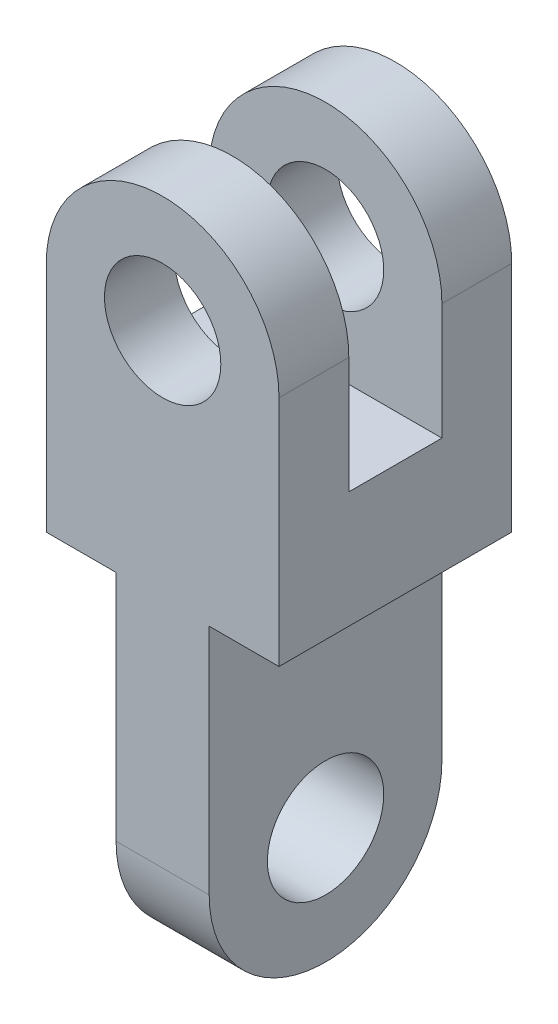
ISO-10303-21;
HEADER;
FILE_DESCRIPTION(('STEP AP214'),'2;1');
FILE_NAME('part.step','',(''),(''),'','','');
FILE_SCHEMA(('AUTOMOTIVE_DESIGN { 1 0 10303 214 1 1 1 1 }'));
ENDSEC;
DATA;
#1=APPLICATION_CONTEXT('core data for automotive mechanical design processes');
#2=APPLICATION_PROTOCOL_DEFINITION('international standard','automotive_design',2000,#1);
#3=PRODUCT_CONTEXT('',#1,'mechanical');
#4=PRODUCT('Part','Part','',(#3));
#5=PRODUCT_RELATED_PRODUCT_CATEGORY('part','',(#4));
#6=PRODUCT_DEFINITION_FORMATION('','',#4);
#7=PRODUCT_DEFINITION_CONTEXT('part definition',#1,'design');
#8=PRODUCT_DEFINITION('design','',#6,#7);
#9=PRODUCT_DEFINITION_SHAPE('','',#8);
#10=(LENGTH_UNIT() NAMED_UNIT(*) SI_UNIT(.MILLI.,.METRE.));
#11=(NAMED_UNIT(*) PLANE_ANGLE_UNIT() SI_UNIT($,.RADIAN.));
#12=(NAMED_UNIT(*) SI_UNIT($,.STERADIAN.) SOLID_ANGLE_UNIT());
#13=UNCERTAINTY_MEASURE_WITH_UNIT(LENGTH_MEASURE(1.E-05),#10,'distance_accuracy_value','');
#14=(GEOMETRIC_REPRESENTATION_CONTEXT(3) GLOBAL_UNCERTAINTY_ASSIGNED_CONTEXT((#13)) GLOBAL_UNIT_ASSIGNED_CONTEXT((#10,
#11,#12)) REPRESENTATION_CONTEXT('',''));
#15=CARTESIAN_POINT('',(0.,0.,0.));
#16=DIRECTION('',(0.,0.,1.));
#17=DIRECTION('',(1.,0.,0.));
#18=AXIS2_PLACEMENT_3D('',#15,#16,#17);
#19=CARTESIAN_POINT('',(70.,150.,100.));
#20=DIRECTION('',(-1.,0.,0.));
#21=DIRECTION('',(0.,0.,1.));
#22=AXIS2_PLACEMENT_3D('',#19,#20,#21);
#23=PLANE('',#22);
#24=DIRECTION('',(0.,-1.,0.));
#25=VECTOR('',#24,1.);
#26=CARTESIAN_POINT('',(70.,0.,30.));
#27=LINE('',#26,#25);
#28=CARTESIAN_POINT('',(70.,250.,30.));
#29=VERTEX_POINT('',#28);
#30=CARTESIAN_POINT('',(70.,200.,30.));
#31=VERTEX_POINT('',#30);
#32=EDGE_CURVE('E207',#29,#31,#27,.T.);
#33=ORIENTED_EDGE('',*,*,#32,.T.);
#34=DIRECTION('',(0.,0.,1.));
#35=VECTOR('',#34,1.);
#36=CARTESIAN_POINT('',(70.,200.,0.));
#37=LINE('',#36,#35);
#38=CARTESIAN_POINT('',(70.,200.,70.));
#39=VERTEX_POINT('',#38);
#40=EDGE_CURVE('E308',#31,#39,#37,.T.);
#41=ORIENTED_EDGE('',*,*,#40,.T.);
#42=DIRECTION('',(0.,1.,0.));
#43=VECTOR('',#42,1.);
#44=CARTESIAN_POINT('',(70.,0.,70.));
#45=LINE('',#44,#43);
#46=CARTESIAN_POINT('',(70.,250.,70.));
#47=VERTEX_POINT('',#46);
#48=EDGE_CURVE('E310',#39,#47,#45,.T.);
#49=ORIENTED_EDGE('',*,*,#48,.T.);
#50=DIRECTION('',(0.,0.,-1.));
#51=VECTOR('',#50,1.);
#52=CARTESIAN_POINT('',(70.,250.,100.));
#53=LINE('',#52,#51);
#54=CARTESIAN_POINT('',(70.,250.,100.));
#55=VERTEX_POINT('',#54);
#56=EDGE_CURVE('E177',#55,#47,#53,.T.);
#57=ORIENTED_EDGE('',*,*,#56,.F.);
#58=DIRECTION('',(0.,1.,0.));
#59=VECTOR('',#58,1.);
#60=CARTESIAN_POINT('',(70.,150.,100.));
#61=LINE('',#60,#59);
#62=CARTESIAN_POINT('',(70.,150.,100.));
#63=VERTEX_POINT('',#62);
#64=EDGE_CURVE('E119',#63,#55,#61,.T.);
#65=ORIENTED_EDGE('',*,*,#64,.F.);
#66=DIRECTION('',(0.,0.,-1.));
#67=VECTOR('',#66,1.);
#68=CARTESIAN_POINT('',(70.,150.,100.));
#69=LINE('',#68,#67);
#70=CARTESIAN_POINT('',(70.,150.,0.));
#71=VERTEX_POINT('',#70);
#72=EDGE_CURVE('E180',#63,#71,#69,.T.);
#73=ORIENTED_EDGE('',*,*,#72,.T.);
#74=DIRECTION('',(0.,1.,0.));
#75=VECTOR('',#74,1.);
#76=CARTESIAN_POINT('',(70.,150.,0.));
#77=LINE('',#76,#75);
#78=CARTESIAN_POINT('',(70.,250.,0.));
#79=VERTEX_POINT('',#78);
#80=EDGE_CURVE('E159',#71,#79,#77,.T.);
#81=ORIENTED_EDGE('',*,*,#80,.T.);
#82=EDGE_CURVE('E135',#29,#79,#53,.T.);
#83=ORIENTED_EDGE('',*,*,#82,.F.);
#84=EDGE_LOOP('',(#33,#41,#49,#57,#65,#73,#81,#83));
#85=FACE_BOUND('',#84,.T.);
#86=ADVANCED_FACE('F39',(#85),#23,.F.);
#87=CARTESIAN_POINT('',(20.,250.,100.));
#88=DIRECTION('',(0.,0.,-1.));
#89=DIRECTION('',(-1.,0.,0.));
#90=AXIS2_PLACEMENT_3D('',#87,#88,#89);
#91=CYLINDRICAL_SURFACE('',#90,50.);
#92=CARTESIAN_POINT('',(20.,250.,30.));
#93=DIRECTION('',(0.,0.,1.));
#94=DIRECTION('',(0.,-1.,0.));
#95=AXIS2_PLACEMENT_3D('',#92,#93,#94);
#96=CIRCLE('',#95,50.);
#97=CARTESIAN_POINT('',(-30.,250.,30.));
#98=VERTEX_POINT('',#97);
#99=EDGE_CURVE('E210',#29,#98,#96,.T.);
#100=ORIENTED_EDGE('',*,*,#99,.F.);
#101=ORIENTED_EDGE('',*,*,#82,.T.);
#102=CARTESIAN_POINT('',(20.,250.,0.));
#103=DIRECTION('',(0.,0.,1.));
#104=DIRECTION('',(-1.,0.,0.));
#105=AXIS2_PLACEMENT_3D('',#102,#103,#104);
#106=CIRCLE('',#105,50.);
#107=CARTESIAN_POINT('',(-30.,250.,0.));
#108=VERTEX_POINT('',#107);
#109=EDGE_CURVE('E163',#79,#108,#106,.T.);
#110=ORIENTED_EDGE('',*,*,#109,.T.);
#111=DIRECTION('',(0.,0.,-1.));
#112=VECTOR('',#111,1.);
#113=CARTESIAN_POINT('',(-30.,250.,100.));
#114=LINE('',#113,#112);
#115=EDGE_CURVE('E136',#98,#108,#114,.T.);
#116=ORIENTED_EDGE('',*,*,#115,.F.);
#117=EDGE_LOOP('',(#100,#101,#110,#116));
#118=FACE_BOUND('',#117,.T.);
#119=ADVANCED_FACE('F272',(#118),#91,.T.);
#120=CARTESIAN_POINT('',(20.,250.,70.));
#121=DIRECTION('',(0.,0.,-1.));
#122=DIRECTION('',(-1.,0.,0.));
#123=AXIS2_PLACEMENT_3D('',#120,#121,#122);
#124=CIRCLE('',#123,50.);
#125=CARTESIAN_POINT('',(-30.,250.,70.));
#126=VERTEX_POINT('',#125);
#127=EDGE_CURVE('E131',#126,#47,#124,.T.);
#128=ORIENTED_EDGE('',*,*,#127,.F.);
#129=CARTESIAN_POINT('',(-30.,250.,100.));
#130=VERTEX_POINT('',#129);
#131=EDGE_CURVE('E127',#130,#126,#114,.T.);
#132=ORIENTED_EDGE('',*,*,#131,.F.);
#133=CARTESIAN_POINT('',(20.,250.,100.));
#134=DIRECTION('',(0.,0.,1.));
#135=DIRECTION('',(-1.,0.,0.));
#136=AXIS2_PLACEMENT_3D('',#133,#134,#135);
#137=CIRCLE('',#136,50.);
#138=EDGE_CURVE('E111',#55,#130,#137,.T.);
#139=ORIENTED_EDGE('',*,*,#138,.F.);
#140=ORIENTED_EDGE('',*,*,#56,.T.);
#141=EDGE_LOOP('',(#128,#132,#139,#140));
#142=FACE_BOUND('',#141,.T.);
#143=ADVANCED_FACE('F128',(#142),#91,.T.);
#144=CARTESIAN_POINT('',(-30.,250.,100.));
#145=DIRECTION('',(1.,0.,0.));
#146=DIRECTION('',(0.,1.,0.));
#147=AXIS2_PLACEMENT_3D('',#144,#145,#146);
#148=PLANE('',#147);
#149=DIRECTION('',(0.,-1.,0.));
#150=VECTOR('',#149,1.);
#151=CARTESIAN_POINT('',(-30.,0.,30.));
#152=LINE('',#151,#150);
#153=CARTESIAN_POINT('',(-30.,200.,30.));
#154=VERTEX_POINT('',#153);
#155=EDGE_CURVE('E204',#98,#154,#152,.T.);
#156=ORIENTED_EDGE('',*,*,#155,.F.);
#157=ORIENTED_EDGE('',*,*,#115,.T.);
#158=DIRECTION('',(0.,-1.,0.));
#159=VECTOR('',#158,1.);
#160=CARTESIAN_POINT('',(-30.,250.,0.));
#161=LINE('',#160,#159);
#162=CARTESIAN_POINT('',(-30.,150.,0.));
#163=VERTEX_POINT('',#162);
#164=EDGE_CURVE('E167',#108,#163,#161,.T.);
#165=ORIENTED_EDGE('',*,*,#164,.T.);
#166=DIRECTION('',(0.,0.,-1.));
#167=VECTOR('',#166,1.);
#168=CARTESIAN_POINT('',(-30.,150.,100.));
#169=LINE('',#168,#167);
#170=CARTESIAN_POINT('',(-30.,150.,100.));
#171=VERTEX_POINT('',#170);
#172=EDGE_CURVE('E140',#171,#163,#169,.T.);
#173=ORIENTED_EDGE('',*,*,#172,.F.);
#174=DIRECTION('',(0.,-1.,0.));
#175=VECTOR('',#174,1.);
#176=CARTESIAN_POINT('',(-30.,250.,100.));
#177=LINE('',#176,#175);
#178=EDGE_CURVE('E116',#130,#171,#177,.T.);
#179=ORIENTED_EDGE('',*,*,#178,.F.);
#180=ORIENTED_EDGE('',*,*,#131,.T.);
#181=DIRECTION('',(0.,1.,0.));
#182=VECTOR('',#181,1.);
#183=CARTESIAN_POINT('',(-30.,0.,70.));
#184=LINE('',#183,#182);
#185=CARTESIAN_POINT('',(-30.,200.,70.));
#186=VERTEX_POINT('',#185);
#187=EDGE_CURVE('E315',#186,#126,#184,.T.);
#188=ORIENTED_EDGE('',*,*,#187,.F.);
#189=DIRECTION('',(0.,0.,1.));
#190=VECTOR('',#189,1.);
#191=CARTESIAN_POINT('',(-30.,200.,0.));
#192=LINE('',#191,#190);
#193=EDGE_CURVE('E269',#154,#186,#192,.T.);
#194=ORIENTED_EDGE('',*,*,#193,.F.);
#195=EDGE_LOOP('',(#156,#157,#165,#173,#179,#180,#188,#194));
#196=FACE_BOUND('',#195,.T.);
#197=ADVANCED_FACE('F139',(#196),#148,.F.);
#198=CARTESIAN_POINT('',(20.,250.,100.));
#199=DIRECTION('',(0.,0.,-1.));
#200=DIRECTION('',(-1.,0.,0.));
#201=AXIS2_PLACEMENT_3D('',#198,#199,#200);
#202=CYLINDRICAL_SURFACE('',#201,25.);
#203=CARTESIAN_POINT('',(20.,250.,0.));
#204=DIRECTION('',(0.,0.,1.));
#205=DIRECTION('',(1.,0.,0.));
#206=AXIS2_PLACEMENT_3D('',#203,#204,#205);
#207=CIRCLE('',#206,25.);
#208=CARTESIAN_POINT('',(45.,250.,0.));
#209=VERTEX_POINT('',#208);
#210=EDGE_CURVE('E233',#209,#209,#207,.T.);
#211=ORIENTED_EDGE('',*,*,#210,.F.);
#212=EDGE_LOOP('',(#211));
#213=FACE_BOUND('',#212,.T.);
#214=CARTESIAN_POINT('',(20.,250.,30.));
#215=DIRECTION('',(0.,0.,1.));
#216=DIRECTION('',(0.,-1.,0.));
#217=AXIS2_PLACEMENT_3D('',#214,#215,#216);
#218=CIRCLE('',#217,25.);
#219=CARTESIAN_POINT('',(20.,225.,30.));
#220=VERTEX_POINT('',#219);
#221=EDGE_CURVE('E43',#220,#220,#218,.T.);
#222=ORIENTED_EDGE('',*,*,#221,.T.);
#223=EDGE_LOOP('',(#222));
#224=FACE_BOUND('',#223,.T.);
#225=ADVANCED_FACE('F251',(#213,#224),#202,.F.);
#226=CARTESIAN_POINT('',(20.,250.,100.));
#227=DIRECTION('',(0.,0.,1.));
#228=DIRECTION('',(1.,0.,0.));
#229=AXIS2_PLACEMENT_3D('',#226,#227,#228);
#230=CIRCLE('',#229,25.);
#231=CARTESIAN_POINT('',(45.,250.,100.));
#232=VERTEX_POINT('',#231);
#233=EDGE_CURVE('E153',#232,#232,#230,.T.);
#234=ORIENTED_EDGE('',*,*,#233,.T.);
#235=EDGE_LOOP('',(#234));
#236=FACE_BOUND('',#235,.T.);
#237=CARTESIAN_POINT('',(20.,250.,70.));
#238=DIRECTION('',(0.,0.,-1.));
#239=DIRECTION('',(-1.,0.,0.));
#240=AXIS2_PLACEMENT_3D('',#237,#238,#239);
#241=CIRCLE('',#240,25.);
#242=CARTESIAN_POINT('',(-5.00000000000001,250.,70.));
#243=VERTEX_POINT('',#242);
#244=EDGE_CURVE('E186',#243,#243,#241,.T.);
#245=ORIENTED_EDGE('',*,*,#244,.T.);
#246=EDGE_LOOP('',(#245));
#247=FACE_BOUND('',#246,.T.);
#248=ADVANCED_FACE('F347',(#236,#247),#202,.F.);
#249=CARTESIAN_POINT('',(0.,150.,100.));
#250=DIRECTION('',(1.,0.,0.));
#251=DIRECTION('',(0.,1.,0.));
#252=AXIS2_PLACEMENT_3D('',#249,#250,#251);
#253=PLANE('',#252);
#254=CARTESIAN_POINT('',(0.,50.,50.));
#255=DIRECTION('',(1.,0.,0.));
#256=DIRECTION('',(0.,1.,0.));
#257=AXIS2_PLACEMENT_3D('',#254,#255,#256);
#258=CIRCLE('',#257,25.);
#259=CARTESIAN_POINT('',(0.,75.,50.));
#260=VERTEX_POINT('',#259);
#261=EDGE_CURVE('E218',#260,#260,#258,.T.);
#262=ORIENTED_EDGE('',*,*,#261,.T.);
#263=EDGE_LOOP('',(#262));
#264=FACE_BOUND('',#263,.T.);
#265=DIRECTION('',(0.,-1.,0.));
#266=VECTOR('',#265,1.);
#267=CARTESIAN_POINT('',(0.,150.,0.));
#268=LINE('',#267,#266);
#269=CARTESIAN_POINT('',(0.,150.,0.));
#270=VERTEX_POINT('',#269);
#271=CARTESIAN_POINT('',(0.,50.,0.));
#272=VERTEX_POINT('',#271);
#273=EDGE_CURVE('E148',#270,#272,#268,.T.);
#274=ORIENTED_EDGE('',*,*,#273,.T.);
#275=CARTESIAN_POINT('',(0.,50.,50.));
#276=DIRECTION('',(1.,0.,0.));
#277=DIRECTION('',(0.,1.,0.));
#278=AXIS2_PLACEMENT_3D('',#275,#276,#277);
#279=CIRCLE('',#278,50.);
#280=CARTESIAN_POINT('',(0.,50.,100.));
#281=VERTEX_POINT('',#280);
#282=EDGE_CURVE('E229',#281,#272,#279,.T.);
#283=ORIENTED_EDGE('',*,*,#282,.F.);
#284=DIRECTION('',(0.,-1.,0.));
#285=VECTOR('',#284,1.);
#286=CARTESIAN_POINT('',(0.,150.,100.));
#287=LINE('',#286,#285);
#288=CARTESIAN_POINT('',(0.,150.,100.));
#289=VERTEX_POINT('',#288);
#290=EDGE_CURVE('E172',#289,#281,#287,.T.);
#291=ORIENTED_EDGE('',*,*,#290,.F.);
#292=DIRECTION('',(0.,0.,-1.));
#293=VECTOR('',#292,1.);
#294=CARTESIAN_POINT('',(0.,150.,100.));
#295=LINE('',#294,#293);
#296=EDGE_CURVE('E144',#289,#270,#295,.T.);
#297=ORIENTED_EDGE('',*,*,#296,.T.);
#298=EDGE_LOOP('',(#274,#283,#291,#297));
#299=FACE_BOUND('',#298,.T.);
#300=ADVANCED_FACE('F41',(#264,#299),#253,.F.);
#301=CARTESIAN_POINT('',(40.,0.,100.));
#302=DIRECTION('',(-1.,0.,0.));
#303=DIRECTION('',(0.,0.,1.));
#304=AXIS2_PLACEMENT_3D('',#301,#302,#303);
#305=PLANE('',#304);
#306=CARTESIAN_POINT('',(40.,50.,50.));
#307=DIRECTION('',(1.,0.,0.));
#308=DIRECTION('',(0.,0.,-1.));
#309=AXIS2_PLACEMENT_3D('',#306,#307,#308);
#310=CIRCLE('',#309,25.);
#311=CARTESIAN_POINT('',(40.,50.,25.));
#312=VERTEX_POINT('',#311);
#313=EDGE_CURVE('E214',#312,#312,#310,.T.);
#314=ORIENTED_EDGE('',*,*,#313,.F.);
#315=EDGE_LOOP('',(#314));
#316=FACE_BOUND('',#315,.T.);
#317=CARTESIAN_POINT('',(40.,50.,50.));
#318=DIRECTION('',(1.,0.,0.));
#319=DIRECTION('',(0.,0.,-1.));
#320=AXIS2_PLACEMENT_3D('',#317,#318,#319);
#321=CIRCLE('',#320,50.);
#322=CARTESIAN_POINT('',(40.,50.,100.));
#323=VERTEX_POINT('',#322);
#324=CARTESIAN_POINT('',(40.,50.,0.));
#325=VERTEX_POINT('',#324);
#326=EDGE_CURVE('E222',#323,#325,#321,.T.);
#327=ORIENTED_EDGE('',*,*,#326,.T.);
#328=DIRECTION('',(0.,1.,0.));
#329=VECTOR('',#328,1.);
#330=CARTESIAN_POINT('',(40.,0.,0.));
#331=LINE('',#330,#329);
#332=CARTESIAN_POINT('',(40.,150.,0.));
#333=VERTEX_POINT('',#332);
#334=EDGE_CURVE('E152',#325,#333,#331,.T.);
#335=ORIENTED_EDGE('',*,*,#334,.T.);
#336=DIRECTION('',(0.,0.,-1.));
#337=VECTOR('',#336,1.);
#338=CARTESIAN_POINT('',(40.,150.,100.));
#339=LINE('',#338,#337);
#340=CARTESIAN_POINT('',(40.,150.,100.));
#341=VERTEX_POINT('',#340);
#342=EDGE_CURVE('E49',#341,#333,#339,.T.);
#343=ORIENTED_EDGE('',*,*,#342,.F.);
#344=DIRECTION('',(0.,1.,0.));
#345=VECTOR('',#344,1.);
#346=CARTESIAN_POINT('',(40.,0.,100.));
#347=LINE('',#346,#345);
#348=EDGE_CURVE('E101',#323,#341,#347,.T.);
#349=ORIENTED_EDGE('',*,*,#348,.F.);
#350=EDGE_LOOP('',(#327,#335,#343,#349));
#351=FACE_BOUND('',#350,.T.);
#352=ADVANCED_FACE('F339',(#316,#351),#305,.F.);
#353=CARTESIAN_POINT('',(20.,250.,100.));
#354=DIRECTION('',(0.,0.,-1.));
#355=DIRECTION('',(-1.,0.,0.));
#356=AXIS2_PLACEMENT_3D('',#353,#354,#355);
#357=PLANE('',#356);
#358=ORIENTED_EDGE('',*,*,#290,.T.);
#359=DIRECTION('',(1.,0.,0.));
#360=VECTOR('',#359,1.);
#361=CARTESIAN_POINT('',(-60.,50.,100.));
#362=LINE('',#361,#360);
#363=EDGE_CURVE('E226',#281,#323,#362,.T.);
#364=ORIENTED_EDGE('',*,*,#363,.T.);
#365=ORIENTED_EDGE('',*,*,#348,.T.);
#366=DIRECTION('',(1.,0.,0.));
#367=VECTOR('',#366,1.);
#368=CARTESIAN_POINT('',(40.,150.,100.));
#369=LINE('',#368,#367);
#370=EDGE_CURVE('E244',#341,#63,#369,.T.);
#371=ORIENTED_EDGE('',*,*,#370,.T.);
#372=ORIENTED_EDGE('',*,*,#64,.T.);
#373=ORIENTED_EDGE('',*,*,#138,.T.);
#374=ORIENTED_EDGE('',*,*,#178,.T.);
#375=DIRECTION('',(1.,0.,0.));
#376=VECTOR('',#375,1.);
#377=CARTESIAN_POINT('',(-30.,150.,100.));
#378=LINE('',#377,#376);
#379=EDGE_CURVE('E66',#171,#289,#378,.T.);
#380=ORIENTED_EDGE('',*,*,#379,.T.);
#381=EDGE_LOOP('',(#358,#364,#365,#371,#372,#373,#374,#380));
#382=FACE_BOUND('',#381,.T.);
#383=ORIENTED_EDGE('',*,*,#233,.F.);
#384=EDGE_LOOP('',(#383));
#385=FACE_BOUND('',#384,.T.);
#386=ADVANCED_FACE('F113',(#382,#385),#357,.F.);
#387=CARTESIAN_POINT('',(20.,250.,0.));
#388=DIRECTION('',(0.,0.,-1.));
#389=DIRECTION('',(-1.,0.,0.));
#390=AXIS2_PLACEMENT_3D('',#387,#388,#389);
#391=PLANE('',#390);
#392=DIRECTION('',(1.,0.,0.));
#393=VECTOR('',#392,1.);
#394=CARTESIAN_POINT('',(-60.,50.,0.));
#395=LINE('',#394,#393);
#396=EDGE_CURVE('E11',#272,#325,#395,.T.);
#397=ORIENTED_EDGE('',*,*,#396,.F.);
#398=ORIENTED_EDGE('',*,*,#273,.F.);
#399=DIRECTION('',(1.,0.,0.));
#400=VECTOR('',#399,1.);
#401=CARTESIAN_POINT('',(-30.,150.,0.));
#402=LINE('',#401,#400);
#403=EDGE_CURVE('E93',#163,#270,#402,.T.);
#404=ORIENTED_EDGE('',*,*,#403,.F.);
#405=ORIENTED_EDGE('',*,*,#164,.F.);
#406=ORIENTED_EDGE('',*,*,#109,.F.);
#407=ORIENTED_EDGE('',*,*,#80,.F.);
#408=DIRECTION('',(1.,0.,0.));
#409=VECTOR('',#408,1.);
#410=CARTESIAN_POINT('',(40.,150.,0.));
#411=LINE('',#410,#409);
#412=EDGE_CURVE('E156',#333,#71,#411,.T.);
#413=ORIENTED_EDGE('',*,*,#412,.F.);
#414=ORIENTED_EDGE('',*,*,#334,.F.);
#415=EDGE_LOOP('',(#397,#398,#404,#405,#406,#407,#413,#414));
#416=FACE_BOUND('',#415,.T.);
#417=ORIENTED_EDGE('',*,*,#210,.T.);
#418=EDGE_LOOP('',(#417));
#419=FACE_BOUND('',#418,.T.);
#420=ADVANCED_FACE('F283',(#416,#419),#391,.T.);
#421=CARTESIAN_POINT('',(40.,150.,100.));
#422=DIRECTION('',(0.,1.,0.));
#423=DIRECTION('',(0.,0.,1.));
#424=AXIS2_PLACEMENT_3D('',#421,#422,#423);
#425=PLANE('',#424);
#426=ORIENTED_EDGE('',*,*,#412,.T.);
#427=ORIENTED_EDGE('',*,*,#72,.F.);
#428=ORIENTED_EDGE('',*,*,#370,.F.);
#429=ORIENTED_EDGE('',*,*,#342,.T.);
#430=EDGE_LOOP('',(#426,#427,#428,#429));
#431=FACE_BOUND('',#430,.T.);
#432=ADVANCED_FACE('F336',(#431),#425,.F.);
#433=CARTESIAN_POINT('',(-30.,150.,100.));
#434=DIRECTION('',(0.,1.,0.));
#435=DIRECTION('',(0.,0.,1.));
#436=AXIS2_PLACEMENT_3D('',#433,#434,#435);
#437=PLANE('',#436);
#438=ORIENTED_EDGE('',*,*,#403,.T.);
#439=ORIENTED_EDGE('',*,*,#296,.F.);
#440=ORIENTED_EDGE('',*,*,#379,.F.);
#441=ORIENTED_EDGE('',*,*,#172,.T.);
#442=EDGE_LOOP('',(#438,#439,#440,#441));
#443=FACE_BOUND('',#442,.T.);
#444=ADVANCED_FACE('F286',(#443),#437,.F.);
#445=CARTESIAN_POINT('',(-60.,50.,50.));
#446=DIRECTION('',(1.,0.,0.));
#447=DIRECTION('',(0.,0.,-1.));
#448=AXIS2_PLACEMENT_3D('',#445,#446,#447);
#449=CYLINDRICAL_SURFACE('',#448,50.);
#450=ORIENTED_EDGE('',*,*,#282,.T.);
#451=ORIENTED_EDGE('',*,*,#396,.T.);
#452=ORIENTED_EDGE('',*,*,#326,.F.);
#453=ORIENTED_EDGE('',*,*,#363,.F.);
#454=EDGE_LOOP('',(#450,#451,#452,#453));
#455=FACE_BOUND('',#454,.T.);
#456=ADVANCED_FACE('F352',(#455),#449,.T.);
#457=CARTESIAN_POINT('',(-60.,50.,50.));
#458=DIRECTION('',(1.,0.,0.));
#459=DIRECTION('',(0.,0.,-1.));
#460=AXIS2_PLACEMENT_3D('',#457,#458,#459);
#461=CYLINDRICAL_SURFACE('',#460,25.);
#462=ORIENTED_EDGE('',*,*,#313,.T.);
#463=EDGE_LOOP('',(#462));
#464=FACE_BOUND('',#463,.T.);
#465=ORIENTED_EDGE('',*,*,#261,.F.);
#466=EDGE_LOOP('',(#465));
#467=FACE_BOUND('',#466,.T.);
#468=ADVANCED_FACE('F256',(#464,#467),#461,.F.);
#469=CARTESIAN_POINT('',(-30.,0.,30.));
#470=DIRECTION('',(0.,0.,1.));
#471=DIRECTION('',(0.,-1.,0.));
#472=AXIS2_PLACEMENT_3D('',#469,#470,#471);
#473=PLANE('',#472);
#474=ORIENTED_EDGE('',*,*,#221,.F.);
#475=EDGE_LOOP('',(#474));
#476=FACE_BOUND('',#475,.T.);
#477=ORIENTED_EDGE('',*,*,#99,.T.);
#478=ORIENTED_EDGE('',*,*,#155,.T.);
#479=DIRECTION('',(1.,0.,0.));
#480=VECTOR('',#479,1.);
#481=CARTESIAN_POINT('',(-30.,200.,30.));
#482=LINE('',#481,#480);
#483=EDGE_CURVE('E189',#154,#31,#482,.T.);
#484=ORIENTED_EDGE('',*,*,#483,.T.);
#485=ORIENTED_EDGE('',*,*,#32,.F.);
#486=EDGE_LOOP('',(#477,#478,#484,#485));
#487=FACE_BOUND('',#486,.T.);
#488=ADVANCED_FACE('F253',(#476,#487),#473,.T.);
#489=CARTESIAN_POINT('',(-30.,0.,70.));
#490=DIRECTION('',(0.,0.,-1.));
#491=DIRECTION('',(-1.,0.,0.));
#492=AXIS2_PLACEMENT_3D('',#489,#490,#491);
#493=PLANE('',#492);
#494=ORIENTED_EDGE('',*,*,#244,.F.);
#495=EDGE_LOOP('',(#494));
#496=FACE_BOUND('',#495,.T.);
#497=ORIENTED_EDGE('',*,*,#127,.T.);
#498=ORIENTED_EDGE('',*,*,#48,.F.);
#499=DIRECTION('',(1.,0.,0.));
#500=VECTOR('',#499,1.);
#501=CARTESIAN_POINT('',(-30.,200.,70.));
#502=LINE('',#501,#500);
#503=EDGE_CURVE('E57',#186,#39,#502,.T.);
#504=ORIENTED_EDGE('',*,*,#503,.F.);
#505=ORIENTED_EDGE('',*,*,#187,.T.);
#506=EDGE_LOOP('',(#497,#498,#504,#505));
#507=FACE_BOUND('',#506,.T.);
#508=ADVANCED_FACE('F255',(#496,#507),#493,.T.);
#509=CARTESIAN_POINT('',(-30.,200.,0.));
#510=DIRECTION('',(0.,1.,0.));
#511=DIRECTION('',(0.,0.,1.));
#512=AXIS2_PLACEMENT_3D('',#509,#510,#511);
#513=PLANE('',#512);
#514=ORIENTED_EDGE('',*,*,#40,.F.);
#515=ORIENTED_EDGE('',*,*,#483,.F.);
#516=ORIENTED_EDGE('',*,*,#193,.T.);
#517=ORIENTED_EDGE('',*,*,#503,.T.);
#518=EDGE_LOOP('',(#514,#515,#516,#517));
#519=FACE_BOUND('',#518,.T.);
#520=ADVANCED_FACE('F306',(#519),#513,.T.);
#521=CLOSED_SHELL('',(#86,#119,#143,#197,#225,#248,#300,#352,#386,#420,#432,#444,#456,#468,#488,
#508,#520));
#522=MANIFOLD_SOLID_BREP('B2',#521);
#523=ADVANCED_BREP_SHAPE_REPRESENTATION('',(#18,#522),#14);
#524=SHAPE_DEFINITION_REPRESENTATION(#9,#523);
ENDSEC;
END-ISO-10303-21;
